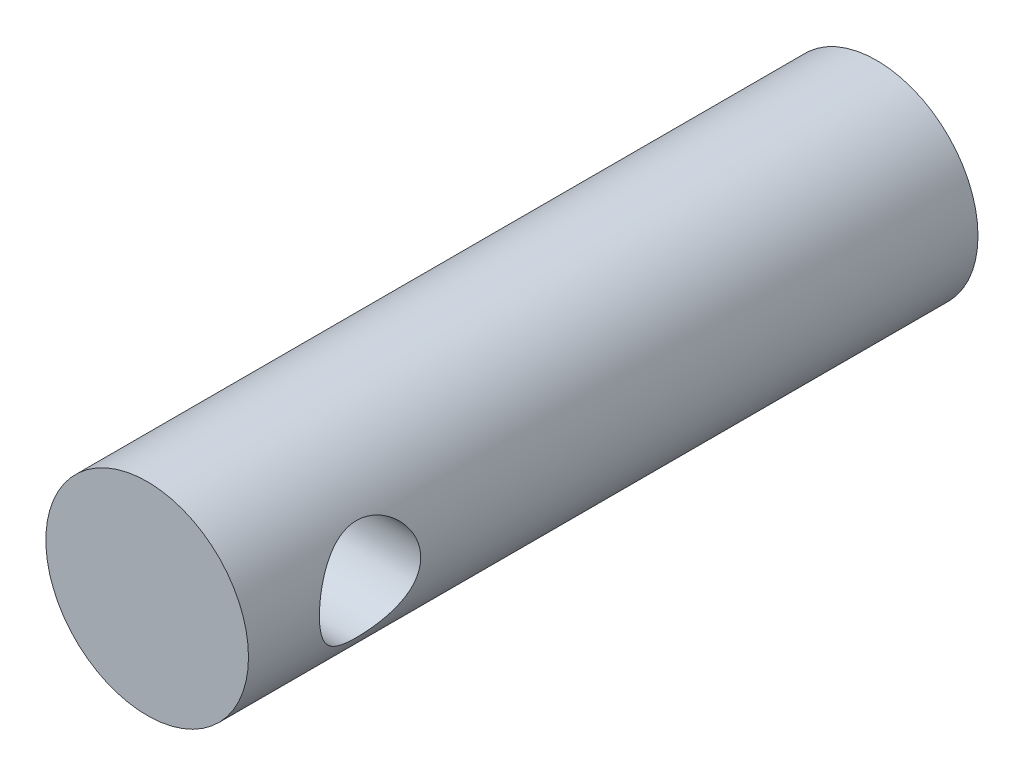
ISO-10303-21;
HEADER;
FILE_DESCRIPTION(('STEP AP214'),'2;1');
FILE_NAME('part.step','',(''),(''),'','','');
FILE_SCHEMA(('AUTOMOTIVE_DESIGN { 1 0 10303 214 1 1 1 1 }'));
ENDSEC;
DATA;
#1=APPLICATION_CONTEXT('core data for automotive mechanical design processes');
#2=APPLICATION_PROTOCOL_DEFINITION('international standard','automotive_design',2000,#1);
#3=PRODUCT_CONTEXT('',#1,'mechanical');
#4=PRODUCT('Part','Part','',(#3));
#5=PRODUCT_RELATED_PRODUCT_CATEGORY('part','',(#4));
#6=PRODUCT_DEFINITION_FORMATION('','',#4);
#7=PRODUCT_DEFINITION_CONTEXT('part definition',#1,'design');
#8=PRODUCT_DEFINITION('design','',#6,#7);
#9=PRODUCT_DEFINITION_SHAPE('','',#8);
#10=(LENGTH_UNIT() NAMED_UNIT(*) SI_UNIT(.MILLI.,.METRE.));
#11=(NAMED_UNIT(*) PLANE_ANGLE_UNIT() SI_UNIT($,.RADIAN.));
#12=(NAMED_UNIT(*) SI_UNIT($,.STERADIAN.) SOLID_ANGLE_UNIT());
#13=UNCERTAINTY_MEASURE_WITH_UNIT(LENGTH_MEASURE(1.E-05),#10,'distance_accuracy_value','');
#14=(GEOMETRIC_REPRESENTATION_CONTEXT(3) GLOBAL_UNCERTAINTY_ASSIGNED_CONTEXT((#13)) GLOBAL_UNIT_ASSIGNED_CONTEXT((#10,
#11,#12)) REPRESENTATION_CONTEXT('',''));
#15=CARTESIAN_POINT('',(0.,0.,0.));
#16=DIRECTION('',(0.,0.,1.));
#17=DIRECTION('',(1.,0.,0.));
#18=AXIS2_PLACEMENT_3D('',#15,#16,#17);
#19=CARTESIAN_POINT('',(0.,0.,18.));
#20=DIRECTION('',(0.,0.,-1.));
#21=DIRECTION('',(-1.,0.,0.));
#22=AXIS2_PLACEMENT_3D('',#19,#20,#21);
#23=CYLINDRICAL_SURFACE('',#22,2.5);
#24=CARTESIAN_POINT('',(-2.5,0.,13.75));
#25=CARTESIAN_POINT('',(-2.49999641755189,0.0657149536912332,13.7500041278994));
#26=CARTESIAN_POINT('',(-2.49738113774397,0.131508249622541,13.7552125914021));
#27=CARTESIAN_POINT('',(-2.48717695046745,0.261150294085532,13.7758161004261));
#28=CARTESIAN_POINT('',(-2.47957859786229,0.32499510839188,13.7912304912471));
#29=CARTESIAN_POINT('',(-2.4602034925414,0.448666931100718,13.831492260771));
#30=CARTESIAN_POINT('',(-2.448442989719,0.508508503673975,13.85630298031));
#31=CARTESIAN_POINT('',(-2.42182220644723,0.623090771008206,13.9144632767062));
#32=CARTESIAN_POINT('',(-2.40696217041913,0.677831867487562,13.9478121803111));
#33=CARTESIAN_POINT('',(-2.37445322822571,0.784384772202398,14.0243965618566));
#34=CARTESIAN_POINT('',(-2.3566899890942,0.835819013902639,14.0681080990496));
#35=CARTESIAN_POINT('',(-2.32074962808431,0.930974306083721,14.1631518490588));
#36=CARTESIAN_POINT('',(-2.30257220261294,0.974689478883458,14.2144898147156));
#37=CARTESIAN_POINT('',(-2.26623688996684,1.05656500056285,14.3281041869042));
#38=CARTESIAN_POINT('',(-2.24818983712665,1.09403166943955,14.3909201229324));
#39=CARTESIAN_POINT('',(-2.21607473465401,1.15771028361337,14.5229591699828));
#40=CARTESIAN_POINT('',(-2.20200384508737,1.18393026870792,14.5921776609034));
#41=CARTESIAN_POINT('',(-2.18072333797261,1.22266555273573,14.7308313817774));
#42=CARTESIAN_POINT('',(-2.17315339479642,1.23590732135055,14.8000055650842));
#43=CARTESIAN_POINT('',(-2.1647736243566,1.25053374163606,14.9399735472243));
#44=CARTESIAN_POINT('',(-2.1639571167911,1.25193011046634,15.0107656760889));
#45=CARTESIAN_POINT('',(-2.16888662821561,1.24335910896537,15.1428575303942));
#46=CARTESIAN_POINT('',(-2.17385954577517,1.23473069942103,15.2042800390288));
#47=CARTESIAN_POINT('',(-2.18845285917313,1.20867481132116,15.3246523867163));
#48=CARTESIAN_POINT('',(-2.1980747353972,1.19124452987206,15.3836014316316));
#49=CARTESIAN_POINT('',(-2.22109345515926,1.1477622254825,15.4990364157071));
#50=CARTESIAN_POINT('',(-2.23457300829998,1.12151883389499,15.5554329984822));
#51=CARTESIAN_POINT('',(-2.26379255351755,1.061302109585,15.6632928657375));
#52=CARTESIAN_POINT('',(-2.27953355975238,1.02732530476558,15.7147539195001));
#53=CARTESIAN_POINT('',(-2.31391447379107,0.947582568640984,15.818151565929));
#54=CARTESIAN_POINT('',(-2.33266887795933,0.900868072961601,15.8693210919702));
#55=CARTESIAN_POINT('',(-2.36934529125509,0.799444473426717,15.9634192732386));
#56=CARTESIAN_POINT('',(-2.38726689948501,0.744731570717857,16.0063439900424));
#57=CARTESIAN_POINT('',(-2.42127484103705,0.62564563228981,16.0846070762872));
#58=CARTESIAN_POINT('',(-2.43723730202509,0.56094198949926,16.1195005905572));
#59=CARTESIAN_POINT('',(-2.46447351401553,0.425582769360995,16.1776212863038));
#60=CARTESIAN_POINT('',(-2.47575098679441,0.354931970331595,16.200857731269));
#61=CARTESIAN_POINT('',(-2.49155417176795,0.215958114575876,16.2330942546458));
#62=CARTESIAN_POINT('',(-2.4965617287664,0.147926913185405,16.2431140446835));
#63=CARTESIAN_POINT('',(-2.50091266823877,0.0109744999366921,16.2518309139181));
#64=CARTESIAN_POINT('',(-2.5002587340164,-0.0579462748373765,16.2505333570493));
#65=CARTESIAN_POINT('',(-2.49363990316801,-0.189041214982492,16.2372416394766));
#66=CARTESIAN_POINT('',(-2.48809057110237,-0.251324260062443,16.2260843340875));
#67=CARTESIAN_POINT('',(-2.47277714143524,-0.373008615377396,16.1947024101311));
#68=CARTESIAN_POINT('',(-2.46301257917916,-0.432409607113746,16.1744767919333));
#69=CARTESIAN_POINT('',(-2.43980314267087,-0.548610760562081,16.1250019169585));
#70=CARTESIAN_POINT('',(-2.42626102212424,-0.605287996257692,16.095511187354));
#71=CARTESIAN_POINT('',(-2.39679967896386,-0.713076702123651,16.0286155804424));
#72=CARTESIAN_POINT('',(-2.38087944457231,-0.764185787219102,15.9912073317582));
#73=CARTESIAN_POINT('',(-2.34635276671831,-0.864709611613316,15.9052994683339));
#74=CARTESIAN_POINT('',(-2.32763606060552,-0.913465097280798,15.856071414433));
#75=CARTESIAN_POINT('',(-2.29077989504843,-1.00232040139155,15.7500935609134));
#76=CARTESIAN_POINT('',(-2.27264084226908,-1.04241423211355,15.6933386014795));
#77=CARTESIAN_POINT('',(-2.23813990282585,-1.11463489312212,15.5704454322496));
#78=CARTESIAN_POINT('',(-2.2219066207934,-1.1462818698483,15.5039859172393));
#79=CARTESIAN_POINT('',(-2.19467590460158,-1.19760353251725,15.3656124153843));
#80=CARTESIAN_POINT('',(-2.18367172800773,-1.21729364485946,15.2937055918735));
#81=CARTESIAN_POINT('',(-2.16951876260834,-1.2423271093121,15.1538622214232));
#82=CARTESIAN_POINT('',(-2.16571729325614,-1.24886624550108,15.0862071832137));
#83=CARTESIAN_POINT('',(-2.16456693307719,-1.25086144297598,14.9506911660366));
#84=CARTESIAN_POINT('',(-2.16721524534441,-1.2463223082805,14.8828302890757));
#85=CARTESIAN_POINT('',(-2.17797327562531,-1.22740765699033,14.755645623085));
#86=CARTESIAN_POINT('',(-2.18553868102992,-1.2140103929285,14.6961244123195));
#87=CARTESIAN_POINT('',(-2.20463770234897,-1.17896919778081,14.5802398507191));
#88=CARTESIAN_POINT('',(-2.21617259462095,-1.15732261394976,14.523877522385));
#89=CARTESIAN_POINT('',(-2.2428566295566,-1.10476968162585,14.4117189362667));
#90=CARTESIAN_POINT('',(-2.25819652995238,-1.07333892227057,14.3562151227129));
#91=CARTESIAN_POINT('',(-2.29044164543238,-1.00268871454579,14.2509068297743));
#92=CARTESIAN_POINT('',(-2.30734767243153,-0.96346521404831,14.2011053368519));
#93=CARTESIAN_POINT('',(-2.34327903949141,-0.872754158330801,14.102322522053));
#94=CARTESIAN_POINT('',(-2.36231229139336,-0.820355528762714,14.0541761220476));
#95=CARTESIAN_POINT('',(-2.3984719031886,-0.707693507775349,13.9671712707205));
#96=CARTESIAN_POINT('',(-2.4155972326005,-0.647425904070981,13.9283178257171));
#97=CARTESIAN_POINT('',(-2.44622511981379,-0.519914496024933,13.8609545465472));
#98=CARTESIAN_POINT('',(-2.45970120703636,-0.452624379918267,13.8325197882357));
#99=CARTESIAN_POINT('',(-2.48126676704332,-0.313427626617738,13.7877397901013));
#100=CARTESIAN_POINT('',(-2.48937154216165,-0.241534749528957,13.771360191463));
#101=CARTESIAN_POINT('',(-2.49619327387079,-0.140752433104229,13.7576282361552));
#102=CARTESIAN_POINT('',(-2.49761706674002,-0.112702349299373,13.7547716989205));
#103=CARTESIAN_POINT('',(-2.49952121222331,-0.0564396647589471,13.750956668104));
#104=CARTESIAN_POINT('',(-2.50000153879704,-0.0282270595592268,13.749998226911));
#105=CARTESIAN_POINT('',(-2.5,0.,13.75));
#106=B_SPLINE_CURVE_WITH_KNOTS('',3,(#24,#25,#26,#27,#28,#29,#30,#31,#32,#33,#34,#35,#36,#37,
#38,#39,#40,#41,#42,#43,#44,#45,#46,#47,#48,#49,#50,#51,#52,#53,#54,#55,#56,#57,#58,#59,#60,#61,
#62,#63,#64,#65,#66,#67,#68,#69,#70,#71,#72,#73,#74,#75,#76,#77,#78,#79,#80,#81,#82,#83,#84,#85,
#86,#87,#88,#89,#90,#91,#92,#93,#94,#95,#96,#97,#98,#99,#100,#101,#102,#103,#104,#105),
.UNSPECIFIED.,.T.,.F.,(4,2,2,2,2,2,2,2,2,2,2,2,2,2,2,2,2,2,2,2,2,2,2,2,2,2,2,2,2,2,2,2,2,2,2,2,
2,2,2,2,4),(0.,0.197030321775366,0.394435187136497,0.591077694365373,0.787704700726959,
0.996227198397609,1.20490779706754,1.42977158038441,1.65447434872851,1.86572515175287,
2.07676696661275,2.26257140511651,2.44843504907098,2.63862800210609,2.82890651575277,
3.04331176667348,3.25781918248358,3.48228777768051,3.70657771140349,3.91229113089182,
4.11790705639345,4.30758633132652,4.49728652038664,4.69241070034873,4.88761813435424,
5.10199513305523,5.31651985769289,5.54143352699592,5.76605639925972,5.96911634372966,
6.17208824825006,6.35572412805228,6.53941910979597,6.73545570969517,6.93159451423697,
7.15156553440623,7.37165479220715,7.59330017078656,7.81431135781162,7.89894100172121,
7.98357298143558),.UNSPECIFIED.);
#107=CARTESIAN_POINT('',(-2.5,0.,13.75));
#108=VERTEX_POINT('',#107);
#109=EDGE_CURVE('E10',#108,#108,#106,.T.);
#110=ORIENTED_EDGE('',*,*,#109,.T.);
#111=EDGE_LOOP('',(#110));
#112=FACE_BOUND('',#111,.T.);
#113=CARTESIAN_POINT('',(2.5,0.,13.75));
#114=CARTESIAN_POINT('',(2.49999641755189,-0.0657149536912332,13.7500041278994));
#115=CARTESIAN_POINT('',(2.49738113774397,-0.131508249622541,13.7552125914021));
#116=CARTESIAN_POINT('',(2.48717695046745,-0.261150294085532,13.7758161004261));
#117=CARTESIAN_POINT('',(2.47957859786229,-0.32499510839188,13.7912304912471));
#118=CARTESIAN_POINT('',(2.4602034925414,-0.448666931100718,13.831492260771));
#119=CARTESIAN_POINT('',(2.448442989719,-0.508508503673975,13.85630298031));
#120=CARTESIAN_POINT('',(2.42182220644723,-0.623090771008206,13.9144632767062));
#121=CARTESIAN_POINT('',(2.40696217041913,-0.677831867487562,13.9478121803111));
#122=CARTESIAN_POINT('',(2.37445322822571,-0.784384772202398,14.0243965618566));
#123=CARTESIAN_POINT('',(2.3566899890942,-0.835819013902639,14.0681080990496));
#124=CARTESIAN_POINT('',(2.32074962808431,-0.930974306083721,14.1631518490588));
#125=CARTESIAN_POINT('',(2.30257220261294,-0.974689478883458,14.2144898147156));
#126=CARTESIAN_POINT('',(2.26623688996684,-1.05656500056285,14.3281041869042));
#127=CARTESIAN_POINT('',(2.24818983712665,-1.09403166943955,14.3909201229324));
#128=CARTESIAN_POINT('',(2.21607473465401,-1.15771028361337,14.5229591699828));
#129=CARTESIAN_POINT('',(2.20200384508737,-1.18393026870792,14.5921776609034));
#130=CARTESIAN_POINT('',(2.18072333797261,-1.22266555273573,14.7308313817774));
#131=CARTESIAN_POINT('',(2.17315339479642,-1.23590732135055,14.8000055650842));
#132=CARTESIAN_POINT('',(2.1647736243566,-1.25053374163606,14.9399735472243));
#133=CARTESIAN_POINT('',(2.1639571167911,-1.25193011046634,15.0107656760889));
#134=CARTESIAN_POINT('',(2.16888662821561,-1.24335910896537,15.1428575303942));
#135=CARTESIAN_POINT('',(2.17385954577517,-1.23473069942103,15.2042800390288));
#136=CARTESIAN_POINT('',(2.18845285917313,-1.20867481132116,15.3246523867163));
#137=CARTESIAN_POINT('',(2.1980747353972,-1.19124452987206,15.3836014316316));
#138=CARTESIAN_POINT('',(2.22109345515926,-1.1477622254825,15.4990364157071));
#139=CARTESIAN_POINT('',(2.23457300829998,-1.12151883389499,15.5554329984822));
#140=CARTESIAN_POINT('',(2.26379255351755,-1.061302109585,15.6632928657375));
#141=CARTESIAN_POINT('',(2.27953355975238,-1.02732530476558,15.7147539195001));
#142=CARTESIAN_POINT('',(2.31391447379107,-0.947582568640984,15.818151565929));
#143=CARTESIAN_POINT('',(2.33266887795933,-0.900868072961601,15.8693210919702));
#144=CARTESIAN_POINT('',(2.36934529125509,-0.799444473426717,15.9634192732386));
#145=CARTESIAN_POINT('',(2.38726689948501,-0.744731570717857,16.0063439900424));
#146=CARTESIAN_POINT('',(2.42127484103705,-0.62564563228981,16.0846070762872));
#147=CARTESIAN_POINT('',(2.43723730202509,-0.56094198949926,16.1195005905572));
#148=CARTESIAN_POINT('',(2.46447351401553,-0.425582769360995,16.1776212863038));
#149=CARTESIAN_POINT('',(2.47575098679441,-0.354931970331595,16.200857731269));
#150=CARTESIAN_POINT('',(2.49155417176795,-0.215958114575876,16.2330942546458));
#151=CARTESIAN_POINT('',(2.4965617287664,-0.147926913185405,16.2431140446835));
#152=CARTESIAN_POINT('',(2.50091266823877,-0.0109744999366921,16.2518309139181));
#153=CARTESIAN_POINT('',(2.5002587340164,0.0579462748373765,16.2505333570493));
#154=CARTESIAN_POINT('',(2.49363990316801,0.189041214982492,16.2372416394766));
#155=CARTESIAN_POINT('',(2.48809057110237,0.251324260062443,16.2260843340875));
#156=CARTESIAN_POINT('',(2.47277714143524,0.373008615377396,16.1947024101311));
#157=CARTESIAN_POINT('',(2.46301257917916,0.432409607113746,16.1744767919333));
#158=CARTESIAN_POINT('',(2.43980314267087,0.548610760562081,16.1250019169585));
#159=CARTESIAN_POINT('',(2.42626102212424,0.605287996257692,16.095511187354));
#160=CARTESIAN_POINT('',(2.39679967896386,0.713076702123651,16.0286155804424));
#161=CARTESIAN_POINT('',(2.38087944457231,0.764185787219102,15.9912073317582));
#162=CARTESIAN_POINT('',(2.34635276671831,0.864709611613316,15.9052994683339));
#163=CARTESIAN_POINT('',(2.32763606060552,0.913465097280798,15.856071414433));
#164=CARTESIAN_POINT('',(2.29077989504843,1.00232040139155,15.7500935609134));
#165=CARTESIAN_POINT('',(2.27264084226908,1.04241423211355,15.6933386014795));
#166=CARTESIAN_POINT('',(2.23813990282585,1.11463489312212,15.5704454322496));
#167=CARTESIAN_POINT('',(2.2219066207934,1.1462818698483,15.5039859172393));
#168=CARTESIAN_POINT('',(2.19467590460158,1.19760353251725,15.3656124153843));
#169=CARTESIAN_POINT('',(2.18367172800773,1.21729364485946,15.2937055918735));
#170=CARTESIAN_POINT('',(2.16951876260834,1.2423271093121,15.1538622214232));
#171=CARTESIAN_POINT('',(2.16571729325614,1.24886624550108,15.0862071832137));
#172=CARTESIAN_POINT('',(2.16456693307719,1.25086144297598,14.9506911660366));
#173=CARTESIAN_POINT('',(2.16721524534441,1.2463223082805,14.8828302890757));
#174=CARTESIAN_POINT('',(2.17797327562531,1.22740765699033,14.755645623085));
#175=CARTESIAN_POINT('',(2.18553868102992,1.2140103929285,14.6961244123195));
#176=CARTESIAN_POINT('',(2.20463770234897,1.17896919778081,14.5802398507191));
#177=CARTESIAN_POINT('',(2.21617259462095,1.15732261394976,14.523877522385));
#178=CARTESIAN_POINT('',(2.2428566295566,1.10476968162585,14.4117189362667));
#179=CARTESIAN_POINT('',(2.25819652995238,1.07333892227057,14.3562151227129));
#180=CARTESIAN_POINT('',(2.29044164543238,1.00268871454579,14.2509068297743));
#181=CARTESIAN_POINT('',(2.30734767243153,0.96346521404831,14.2011053368519));
#182=CARTESIAN_POINT('',(2.34327903949141,0.872754158330801,14.102322522053));
#183=CARTESIAN_POINT('',(2.36231229139336,0.820355528762714,14.0541761220476));
#184=CARTESIAN_POINT('',(2.3984719031886,0.707693507775349,13.9671712707205));
#185=CARTESIAN_POINT('',(2.4155972326005,0.647425904070981,13.9283178257171));
#186=CARTESIAN_POINT('',(2.44622511981379,0.519914496024933,13.8609545465472));
#187=CARTESIAN_POINT('',(2.45970120703636,0.452624379918267,13.8325197882357));
#188=CARTESIAN_POINT('',(2.48126676704332,0.313427626617738,13.7877397901013));
#189=CARTESIAN_POINT('',(2.48937154216165,0.241534749528957,13.771360191463));
#190=CARTESIAN_POINT('',(2.49619327387079,0.140752433104229,13.7576282361552));
#191=CARTESIAN_POINT('',(2.49761706674002,0.112702349299373,13.7547716989205));
#192=CARTESIAN_POINT('',(2.49952121222331,0.0564396647589471,13.750956668104));
#193=CARTESIAN_POINT('',(2.50000153879704,0.0282270595592268,13.749998226911));
#194=CARTESIAN_POINT('',(2.5,0.,13.75));
#195=B_SPLINE_CURVE_WITH_KNOTS('',3,(#113,#114,#115,#116,#117,#118,#119,#120,#121,#122,#123,
#124,#125,#126,#127,#128,#129,#130,#131,#132,#133,#134,#135,#136,#137,#138,#139,#140,#141,#142,
#143,#144,#145,#146,#147,#148,#149,#150,#151,#152,#153,#154,#155,#156,#157,#158,#159,#160,#161,
#162,#163,#164,#165,#166,#167,#168,#169,#170,#171,#172,#173,#174,#175,#176,#177,#178,#179,#180,
#181,#182,#183,#184,#185,#186,#187,#188,#189,#190,#191,#192,#193,#194),.UNSPECIFIED.,.T.,.F.,(4,
2,2,2,2,2,2,2,2,2,2,2,2,2,2,2,2,2,2,2,2,2,2,2,2,2,2,2,2,2,2,2,2,2,2,2,2,2,2,2,4),(0.,
0.197030321775366,0.394435187136497,0.591077694365373,0.787704700726959,0.996227198397609,
1.20490779706754,1.42977158038441,1.65447434872851,1.86572515175287,2.07676696661275,
2.26257140511651,2.44843504907098,2.63862800210609,2.82890651575277,3.04331176667348,
3.25781918248358,3.48228777768051,3.70657771140349,3.91229113089182,4.11790705639345,
4.30758633132652,4.49728652038664,4.69241070034873,4.88761813435424,5.10199513305523,
5.31651985769289,5.54143352699592,5.76605639925972,5.96911634372966,6.17208824825006,
6.35572412805228,6.53941910979597,6.73545570969517,6.93159451423697,7.15156553440623,
7.37165479220715,7.59330017078656,7.81431135781162,7.89894100172121,7.98357298143558),.UNSPECIFIED.);
#196=CARTESIAN_POINT('',(2.5,0.,13.75));
#197=VERTEX_POINT('',#196);
#198=EDGE_CURVE('E55',#197,#197,#195,.T.);
#199=ORIENTED_EDGE('',*,*,#198,.T.);
#200=EDGE_LOOP('',(#199));
#201=FACE_BOUND('',#200,.T.);
#202=CARTESIAN_POINT('',(0.,0.,18.));
#203=DIRECTION('',(0.,0.,1.));
#204=DIRECTION('',(1.,0.,0.));
#205=AXIS2_PLACEMENT_3D('',#202,#203,#204);
#206=CIRCLE('',#205,2.5);
#207=CARTESIAN_POINT('',(2.5,0.,18.));
#208=VERTEX_POINT('',#207);
#209=EDGE_CURVE('E60',#208,#208,#206,.T.);
#210=ORIENTED_EDGE('',*,*,#209,.F.);
#211=EDGE_LOOP('',(#210));
#212=FACE_BOUND('',#211,.T.);
#213=CARTESIAN_POINT('',(0.,0.,0.));
#214=DIRECTION('',(0.,0.,1.));
#215=DIRECTION('',(1.,0.,0.));
#216=AXIS2_PLACEMENT_3D('',#213,#214,#215);
#217=CIRCLE('',#216,2.5);
#218=CARTESIAN_POINT('',(2.5,0.,0.));
#219=VERTEX_POINT('',#218);
#220=EDGE_CURVE('E65',#219,#219,#217,.T.);
#221=ORIENTED_EDGE('',*,*,#220,.T.);
#222=EDGE_LOOP('',(#221));
#223=FACE_BOUND('',#222,.T.);
#224=ADVANCED_FACE('F43',(#112,#201,#212,#223),#23,.T.);
#225=CARTESIAN_POINT('',(0.,0.,18.));
#226=DIRECTION('',(0.,0.,1.));
#227=DIRECTION('',(1.,0.,0.));
#228=AXIS2_PLACEMENT_3D('',#225,#226,#227);
#229=PLANE('',#228);
#230=ORIENTED_EDGE('',*,*,#209,.T.);
#231=EDGE_LOOP('',(#230));
#232=FACE_BOUND('',#231,.T.);
#233=ADVANCED_FACE('F77',(#232),#229,.T.);
#234=CARTESIAN_POINT('',(0.,0.,0.));
#235=DIRECTION('',(0.,0.,1.));
#236=DIRECTION('',(1.,0.,0.));
#237=AXIS2_PLACEMENT_3D('',#234,#235,#236);
#238=PLANE('',#237);
#239=ORIENTED_EDGE('',*,*,#220,.F.);
#240=EDGE_LOOP('',(#239));
#241=FACE_BOUND('',#240,.T.);
#242=ADVANCED_FACE('F75',(#241),#238,.F.);
#243=CARTESIAN_POINT('',(-2.5,0.,15.));
#244=DIRECTION('',(1.,0.,0.));
#245=DIRECTION('',(0.,0.,-1.));
#246=AXIS2_PLACEMENT_3D('',#243,#244,#245);
#247=CYLINDRICAL_SURFACE('',#246,1.25);
#248=ORIENTED_EDGE('',*,*,#198,.F.);
#249=EDGE_LOOP('',(#248));
#250=FACE_BOUND('',#249,.T.);
#251=ORIENTED_EDGE('',*,*,#109,.F.);
#252=EDGE_LOOP('',(#251));
#253=FACE_BOUND('',#252,.T.);
#254=ADVANCED_FACE('F71',(#250,#253),#247,.F.);
#255=CLOSED_SHELL('',(#224,#233,#242,#254));
#256=MANIFOLD_SOLID_BREP('B2',#255);
#257=ADVANCED_BREP_SHAPE_REPRESENTATION('',(#18,#256),#14);
#258=SHAPE_DEFINITION_REPRESENTATION(#9,#257);
ENDSEC;
END-ISO-10303-21;
